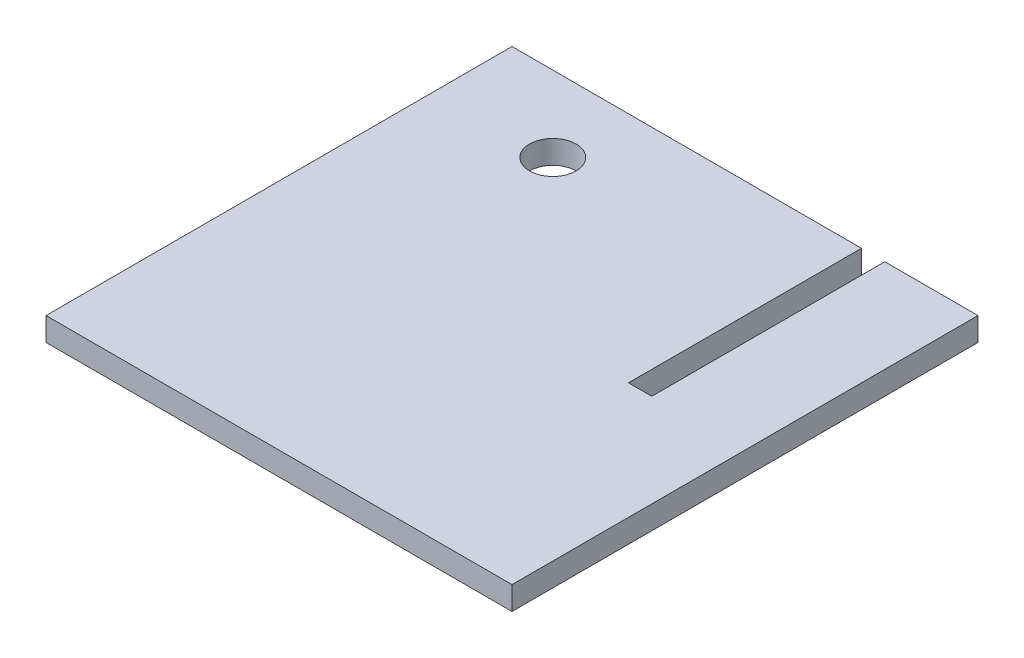
ISO-10303-21;
HEADER;
FILE_DESCRIPTION(('STEP AP214'),'2;1');
FILE_NAME('part.step','',(''),(''),'','','');
FILE_SCHEMA(('AUTOMOTIVE_DESIGN { 1 0 10303 214 1 1 1 1 }'));
ENDSEC;
DATA;
#1=APPLICATION_CONTEXT('core data for automotive mechanical design processes');
#2=APPLICATION_PROTOCOL_DEFINITION('international standard','automotive_design',2000,#1);
#3=PRODUCT_CONTEXT('',#1,'mechanical');
#4=PRODUCT('Part','Part','',(#3));
#5=PRODUCT_RELATED_PRODUCT_CATEGORY('part','',(#4));
#6=PRODUCT_DEFINITION_FORMATION('','',#4);
#7=PRODUCT_DEFINITION_CONTEXT('part definition',#1,'design');
#8=PRODUCT_DEFINITION('design','',#6,#7);
#9=PRODUCT_DEFINITION_SHAPE('','',#8);
#10=(LENGTH_UNIT() NAMED_UNIT(*) SI_UNIT(.MILLI.,.METRE.));
#11=(NAMED_UNIT(*) PLANE_ANGLE_UNIT() SI_UNIT($,.RADIAN.));
#12=(NAMED_UNIT(*) SI_UNIT($,.STERADIAN.) SOLID_ANGLE_UNIT());
#13=UNCERTAINTY_MEASURE_WITH_UNIT(LENGTH_MEASURE(1.E-05),#10,'distance_accuracy_value','');
#14=(GEOMETRIC_REPRESENTATION_CONTEXT(3) GLOBAL_UNCERTAINTY_ASSIGNED_CONTEXT((#13)) GLOBAL_UNIT_ASSIGNED_CONTEXT((#10,
#11,#12)) REPRESENTATION_CONTEXT('',''));
#15=CARTESIAN_POINT('',(0.,0.,0.));
#16=DIRECTION('',(0.,0.,1.));
#17=DIRECTION('',(1.,0.,0.));
#18=AXIS2_PLACEMENT_3D('',#15,#16,#17);
#19=CARTESIAN_POINT('',(-127.,6.35,-254.));
#20=DIRECTION('',(0.,0.,1.));
#21=DIRECTION('',(1.,0.,0.));
#22=AXIS2_PLACEMENT_3D('',#19,#20,#21);
#23=PLANE('',#22);
#24=DIRECTION('',(-1.,0.,0.));
#25=VECTOR('',#24,1.);
#26=CARTESIAN_POINT('',(-127.,-6.35,-254.));
#27=LINE('',#26,#25);
#28=CARTESIAN_POINT('',(127.,-6.35,-254.));
#29=VERTEX_POINT('',#28);
#30=CARTESIAN_POINT('',(76.2000000000002,-6.35,-254.));
#31=VERTEX_POINT('',#30);
#32=EDGE_CURVE('E110',#29,#31,#27,.T.);
#33=ORIENTED_EDGE('',*,*,#32,.T.);
#34=DIRECTION('',(0.,1.,0.));
#35=VECTOR('',#34,1.);
#36=CARTESIAN_POINT('',(76.2000000000002,-6.35,-254.));
#37=LINE('',#36,#35);
#38=CARTESIAN_POINT('',(76.2000000000002,6.35,-254.));
#39=VERTEX_POINT('',#38);
#40=EDGE_CURVE('E152',#31,#39,#37,.T.);
#41=ORIENTED_EDGE('',*,*,#40,.T.);
#42=DIRECTION('',(-1.,0.,0.));
#43=VECTOR('',#42,1.);
#44=CARTESIAN_POINT('',(-127.,6.35,-254.));
#45=LINE('',#44,#43);
#46=CARTESIAN_POINT('',(127.,6.35,-254.));
#47=VERTEX_POINT('',#46);
#48=EDGE_CURVE('E129',#47,#39,#45,.T.);
#49=ORIENTED_EDGE('',*,*,#48,.F.);
#50=DIRECTION('',(0.,-1.,0.));
#51=VECTOR('',#50,1.);
#52=CARTESIAN_POINT('',(127.,6.35,-254.));
#53=LINE('',#52,#51);
#54=EDGE_CURVE('E135',#47,#29,#53,.T.);
#55=ORIENTED_EDGE('',*,*,#54,.T.);
#56=EDGE_LOOP('',(#33,#41,#49,#55));
#57=FACE_BOUND('',#56,.T.);
#58=ADVANCED_FACE('F37',(#57),#23,.F.);
#59=CARTESIAN_POINT('',(-127.,6.35,0.));
#60=DIRECTION('',(1.,0.,0.));
#61=DIRECTION('',(0.,0.,-1.));
#62=AXIS2_PLACEMENT_3D('',#59,#60,#61);
#63=PLANE('',#62);
#64=DIRECTION('',(0.,0.,1.));
#65=VECTOR('',#64,1.);
#66=CARTESIAN_POINT('',(-127.,-6.35,0.));
#67=LINE('',#66,#65);
#68=CARTESIAN_POINT('',(-127.,-6.35,-254.));
#69=VERTEX_POINT('',#68);
#70=CARTESIAN_POINT('',(-127.,-6.35,0.));
#71=VERTEX_POINT('',#70);
#72=EDGE_CURVE('E117',#69,#71,#67,.T.);
#73=ORIENTED_EDGE('',*,*,#72,.T.);
#74=DIRECTION('',(0.,-1.,0.));
#75=VECTOR('',#74,1.);
#76=CARTESIAN_POINT('',(-127.,6.35,0.));
#77=LINE('',#76,#75);
#78=CARTESIAN_POINT('',(-127.,6.35,0.));
#79=VERTEX_POINT('',#78);
#80=EDGE_CURVE('E147',#79,#71,#77,.T.);
#81=ORIENTED_EDGE('',*,*,#80,.F.);
#82=DIRECTION('',(0.,0.,1.));
#83=VECTOR('',#82,1.);
#84=CARTESIAN_POINT('',(-127.,6.35,0.));
#85=LINE('',#84,#83);
#86=CARTESIAN_POINT('',(-127.,6.35,-254.));
#87=VERTEX_POINT('',#86);
#88=EDGE_CURVE('E118',#87,#79,#85,.T.);
#89=ORIENTED_EDGE('',*,*,#88,.F.);
#90=DIRECTION('',(0.,-1.,0.));
#91=VECTOR('',#90,1.);
#92=CARTESIAN_POINT('',(-127.,6.35,-254.));
#93=LINE('',#92,#91);
#94=EDGE_CURVE('E105',#87,#69,#93,.T.);
#95=ORIENTED_EDGE('',*,*,#94,.T.);
#96=EDGE_LOOP('',(#73,#81,#89,#95));
#97=FACE_BOUND('',#96,.T.);
#98=ADVANCED_FACE('F115',(#97),#63,.F.);
#99=CARTESIAN_POINT('',(-127.,6.35,0.));
#100=DIRECTION('',(0.,0.,-1.));
#101=DIRECTION('',(-1.,0.,0.));
#102=AXIS2_PLACEMENT_3D('',#99,#100,#101);
#103=PLANE('',#102);
#104=DIRECTION('',(1.,0.,0.));
#105=VECTOR('',#104,1.);
#106=CARTESIAN_POINT('',(-127.,-6.35,0.));
#107=LINE('',#106,#105);
#108=CARTESIAN_POINT('',(127.,-6.35,0.));
#109=VERTEX_POINT('',#108);
#110=EDGE_CURVE('E61',#71,#109,#107,.T.);
#111=ORIENTED_EDGE('',*,*,#110,.T.);
#112=DIRECTION('',(0.,-1.,0.));
#113=VECTOR('',#112,1.);
#114=CARTESIAN_POINT('',(127.,6.35,0.));
#115=LINE('',#114,#113);
#116=CARTESIAN_POINT('',(127.,6.35,0.));
#117=VERTEX_POINT('',#116);
#118=EDGE_CURVE('E111',#117,#109,#115,.T.);
#119=ORIENTED_EDGE('',*,*,#118,.F.);
#120=DIRECTION('',(1.,0.,0.));
#121=VECTOR('',#120,1.);
#122=CARTESIAN_POINT('',(-127.,6.35,0.));
#123=LINE('',#122,#121);
#124=EDGE_CURVE('E80',#79,#117,#123,.T.);
#125=ORIENTED_EDGE('',*,*,#124,.F.);
#126=ORIENTED_EDGE('',*,*,#80,.T.);
#127=EDGE_LOOP('',(#111,#119,#125,#126));
#128=FACE_BOUND('',#127,.T.);
#129=ADVANCED_FACE('F181',(#128),#103,.F.);
#130=CARTESIAN_POINT('',(127.,6.35,0.));
#131=DIRECTION('',(-1.,0.,0.));
#132=DIRECTION('',(0.,0.,1.));
#133=AXIS2_PLACEMENT_3D('',#130,#131,#132);
#134=PLANE('',#133);
#135=DIRECTION('',(0.,0.,-1.));
#136=VECTOR('',#135,1.);
#137=CARTESIAN_POINT('',(127.,-6.35,0.));
#138=LINE('',#137,#136);
#139=EDGE_CURVE('E146',#109,#29,#138,.T.);
#140=ORIENTED_EDGE('',*,*,#139,.T.);
#141=ORIENTED_EDGE('',*,*,#54,.F.);
#142=DIRECTION('',(0.,0.,-1.));
#143=VECTOR('',#142,1.);
#144=CARTESIAN_POINT('',(127.,6.35,0.));
#145=LINE('',#144,#143);
#146=EDGE_CURVE('E133',#117,#47,#145,.T.);
#147=ORIENTED_EDGE('',*,*,#146,.F.);
#148=ORIENTED_EDGE('',*,*,#118,.T.);
#149=EDGE_LOOP('',(#140,#141,#147,#148));
#150=FACE_BOUND('',#149,.T.);
#151=ADVANCED_FACE('F179',(#150),#134,.F.);
#152=CARTESIAN_POINT('',(63.5000000000002,6.35,-254.));
#153=VERTEX_POINT('',#152);
#154=EDGE_CURVE('E132',#153,#87,#45,.T.);
#155=ORIENTED_EDGE('',*,*,#154,.F.);
#156=DIRECTION('',(0.,1.,0.));
#157=VECTOR('',#156,1.);
#158=CARTESIAN_POINT('',(63.5000000000002,-6.35,-254.));
#159=LINE('',#158,#157);
#160=CARTESIAN_POINT('',(63.5000000000002,-6.35,-254.));
#161=VERTEX_POINT('',#160);
#162=EDGE_CURVE('E108',#161,#153,#159,.T.);
#163=ORIENTED_EDGE('',*,*,#162,.F.);
#164=EDGE_CURVE('E101',#161,#69,#27,.T.);
#165=ORIENTED_EDGE('',*,*,#164,.T.);
#166=ORIENTED_EDGE('',*,*,#94,.F.);
#167=EDGE_LOOP('',(#155,#163,#165,#166));
#168=FACE_BOUND('',#167,.T.);
#169=ADVANCED_FACE('F104',(#168),#23,.F.);
#170=CARTESIAN_POINT('',(0.,6.35,0.));
#171=DIRECTION('',(0.,-1.,0.));
#172=DIRECTION('',(0.,0.,-1.));
#173=AXIS2_PLACEMENT_3D('',#170,#171,#172);
#174=PLANE('',#173);
#175=CARTESIAN_POINT('',(-63.4999999999997,6.34999999999999,-212.750000000006));
#176=DIRECTION('',(0.,-1.,0.));
#177=DIRECTION('',(0.,0.,-1.));
#178=AXIS2_PLACEMENT_3D('',#175,#176,#177);
#179=CIRCLE('',#178,12.7);
#180=CARTESIAN_POINT('',(-63.4999999999997,6.34999999999999,-225.450000000006));
#181=VERTEX_POINT('',#180);
#182=EDGE_CURVE('E11',#181,#181,#179,.F.);
#183=ORIENTED_EDGE('',*,*,#182,.F.);
#184=EDGE_LOOP('',(#183));
#185=FACE_BOUND('',#184,.T.);
#186=ORIENTED_EDGE('',*,*,#48,.T.);
#187=DIRECTION('',(0.,0.,-1.));
#188=VECTOR('',#187,1.);
#189=CARTESIAN_POINT('',(76.2000000000002,6.35,-254.));
#190=LINE('',#189,#188);
#191=CARTESIAN_POINT('',(76.2000000000002,6.35,-127.));
#192=VERTEX_POINT('',#191);
#193=EDGE_CURVE('E167',#192,#39,#190,.T.);
#194=ORIENTED_EDGE('',*,*,#193,.F.);
#195=DIRECTION('',(1.,0.,0.));
#196=VECTOR('',#195,1.);
#197=CARTESIAN_POINT('',(76.2000000000002,6.35,-127.));
#198=LINE('',#197,#196);
#199=CARTESIAN_POINT('',(63.5000000000002,6.35,-127.));
#200=VERTEX_POINT('',#199);
#201=EDGE_CURVE('E162',#200,#192,#198,.T.);
#202=ORIENTED_EDGE('',*,*,#201,.F.);
#203=DIRECTION('',(0.,0.,1.));
#204=VECTOR('',#203,1.);
#205=CARTESIAN_POINT('',(63.5000000000002,6.35,-254.));
#206=LINE('',#205,#204);
#207=EDGE_CURVE('E164',#153,#200,#206,.T.);
#208=ORIENTED_EDGE('',*,*,#207,.F.);
#209=ORIENTED_EDGE('',*,*,#154,.T.);
#210=ORIENTED_EDGE('',*,*,#88,.T.);
#211=ORIENTED_EDGE('',*,*,#124,.T.);
#212=ORIENTED_EDGE('',*,*,#146,.T.);
#213=EDGE_LOOP('',(#186,#194,#202,#208,#209,#210,#211,#212));
#214=FACE_BOUND('',#213,.T.);
#215=ADVANCED_FACE('F39',(#185,#214),#174,.F.);
#216=CARTESIAN_POINT('',(0.,-6.35,0.));
#217=DIRECTION('',(0.,-1.,0.));
#218=DIRECTION('',(0.,0.,-1.));
#219=AXIS2_PLACEMENT_3D('',#216,#217,#218);
#220=PLANE('',#219);
#221=DIRECTION('',(0.,0.,-1.));
#222=VECTOR('',#221,1.);
#223=CARTESIAN_POINT('',(76.2000000000002,-6.35,-254.));
#224=LINE('',#223,#222);
#225=CARTESIAN_POINT('',(76.2000000000002,-6.35,-127.));
#226=VERTEX_POINT('',#225);
#227=EDGE_CURVE('E160',#226,#31,#224,.T.);
#228=ORIENTED_EDGE('',*,*,#227,.T.);
#229=ORIENTED_EDGE('',*,*,#32,.F.);
#230=ORIENTED_EDGE('',*,*,#139,.F.);
#231=ORIENTED_EDGE('',*,*,#110,.F.);
#232=ORIENTED_EDGE('',*,*,#72,.F.);
#233=ORIENTED_EDGE('',*,*,#164,.F.);
#234=DIRECTION('',(0.,0.,1.));
#235=VECTOR('',#234,1.);
#236=CARTESIAN_POINT('',(63.5000000000002,-6.35,-254.));
#237=LINE('',#236,#235);
#238=CARTESIAN_POINT('',(63.5000000000002,-6.35,-127.));
#239=VERTEX_POINT('',#238);
#240=EDGE_CURVE('E158',#161,#239,#237,.T.);
#241=ORIENTED_EDGE('',*,*,#240,.T.);
#242=DIRECTION('',(1.,0.,0.));
#243=VECTOR('',#242,1.);
#244=CARTESIAN_POINT('',(76.2000000000002,-6.35,-127.));
#245=LINE('',#244,#243);
#246=EDGE_CURVE('E52',#239,#226,#245,.T.);
#247=ORIENTED_EDGE('',*,*,#246,.T.);
#248=EDGE_LOOP('',(#228,#229,#230,#231,#232,#233,#241,#247));
#249=FACE_BOUND('',#248,.T.);
#250=CARTESIAN_POINT('',(-63.4999999999997,-6.34999999999999,-212.750000000005));
#251=DIRECTION('',(0.,-1.,0.));
#252=DIRECTION('',(0.,0.,-1.));
#253=AXIS2_PLACEMENT_3D('',#250,#251,#252);
#254=CIRCLE('',#253,12.7);
#255=CARTESIAN_POINT('',(-63.4999999999997,-6.34999999999999,-225.450000000005));
#256=VERTEX_POINT('',#255);
#257=EDGE_CURVE('E45',#256,#256,#254,.F.);
#258=ORIENTED_EDGE('',*,*,#257,.T.);
#259=EDGE_LOOP('',(#258));
#260=FACE_BOUND('',#259,.T.);
#261=ADVANCED_FACE('F121',(#249,#260),#220,.T.);
#262=CARTESIAN_POINT('',(-63.4999999999997,-234.950000000002,-212.750000000003));
#263=DIRECTION('',(0.,1.,0.));
#264=DIRECTION('',(0.,0.,1.));
#265=AXIS2_PLACEMENT_3D('',#262,#263,#264);
#266=CYLINDRICAL_SURFACE('',#265,12.7);
#267=ORIENTED_EDGE('',*,*,#257,.F.);
#268=EDGE_LOOP('',(#267));
#269=FACE_BOUND('',#268,.T.);
#270=ORIENTED_EDGE('',*,*,#182,.T.);
#271=EDGE_LOOP('',(#270));
#272=FACE_BOUND('',#271,.T.);
#273=ADVANCED_FACE('F195',(#269,#272),#266,.F.);
#274=CARTESIAN_POINT('',(76.2000000000002,-6.35,-254.));
#275=DIRECTION('',(1.,0.,0.));
#276=DIRECTION('',(0.,0.,-1.));
#277=AXIS2_PLACEMENT_3D('',#274,#275,#276);
#278=PLANE('',#277);
#279=ORIENTED_EDGE('',*,*,#40,.F.);
#280=ORIENTED_EDGE('',*,*,#227,.F.);
#281=DIRECTION('',(0.,1.,0.));
#282=VECTOR('',#281,1.);
#283=CARTESIAN_POINT('',(76.2000000000002,-6.35,-127.));
#284=LINE('',#283,#282);
#285=EDGE_CURVE('E89',#226,#192,#284,.T.);
#286=ORIENTED_EDGE('',*,*,#285,.T.);
#287=ORIENTED_EDGE('',*,*,#193,.T.);
#288=EDGE_LOOP('',(#279,#280,#286,#287));
#289=FACE_BOUND('',#288,.T.);
#290=ADVANCED_FACE('F173',(#289),#278,.F.);
#291=CARTESIAN_POINT('',(76.2000000000002,-6.35,-127.));
#292=DIRECTION('',(0.,0.,1.));
#293=DIRECTION('',(1.,0.,0.));
#294=AXIS2_PLACEMENT_3D('',#291,#292,#293);
#295=PLANE('',#294);
#296=ORIENTED_EDGE('',*,*,#285,.F.);
#297=ORIENTED_EDGE('',*,*,#246,.F.);
#298=DIRECTION('',(0.,1.,0.));
#299=VECTOR('',#298,1.);
#300=CARTESIAN_POINT('',(63.5000000000002,-6.35,-127.));
#301=LINE('',#300,#299);
#302=EDGE_CURVE('E124',#239,#200,#301,.T.);
#303=ORIENTED_EDGE('',*,*,#302,.T.);
#304=ORIENTED_EDGE('',*,*,#201,.T.);
#305=EDGE_LOOP('',(#296,#297,#303,#304));
#306=FACE_BOUND('',#305,.T.);
#307=ADVANCED_FACE('F267',(#306),#295,.F.);
#308=CARTESIAN_POINT('',(63.5000000000002,-6.35,-254.));
#309=DIRECTION('',(-1.,0.,0.));
#310=DIRECTION('',(0.,0.,1.));
#311=AXIS2_PLACEMENT_3D('',#308,#309,#310);
#312=PLANE('',#311);
#313=ORIENTED_EDGE('',*,*,#302,.F.);
#314=ORIENTED_EDGE('',*,*,#240,.F.);
#315=ORIENTED_EDGE('',*,*,#162,.T.);
#316=ORIENTED_EDGE('',*,*,#207,.T.);
#317=EDGE_LOOP('',(#313,#314,#315,#316));
#318=FACE_BOUND('',#317,.T.);
#319=ADVANCED_FACE('F276',(#318),#312,.F.);
#320=CLOSED_SHELL('',(#58,#98,#129,#151,#169,#215,#261,#273,#290,#307,#319));
#321=MANIFOLD_SOLID_BREP('B2',#320);
#322=ADVANCED_BREP_SHAPE_REPRESENTATION('',(#18,#321),#14);
#323=SHAPE_DEFINITION_REPRESENTATION(#9,#322);
ENDSEC;
END-ISO-10303-21;
